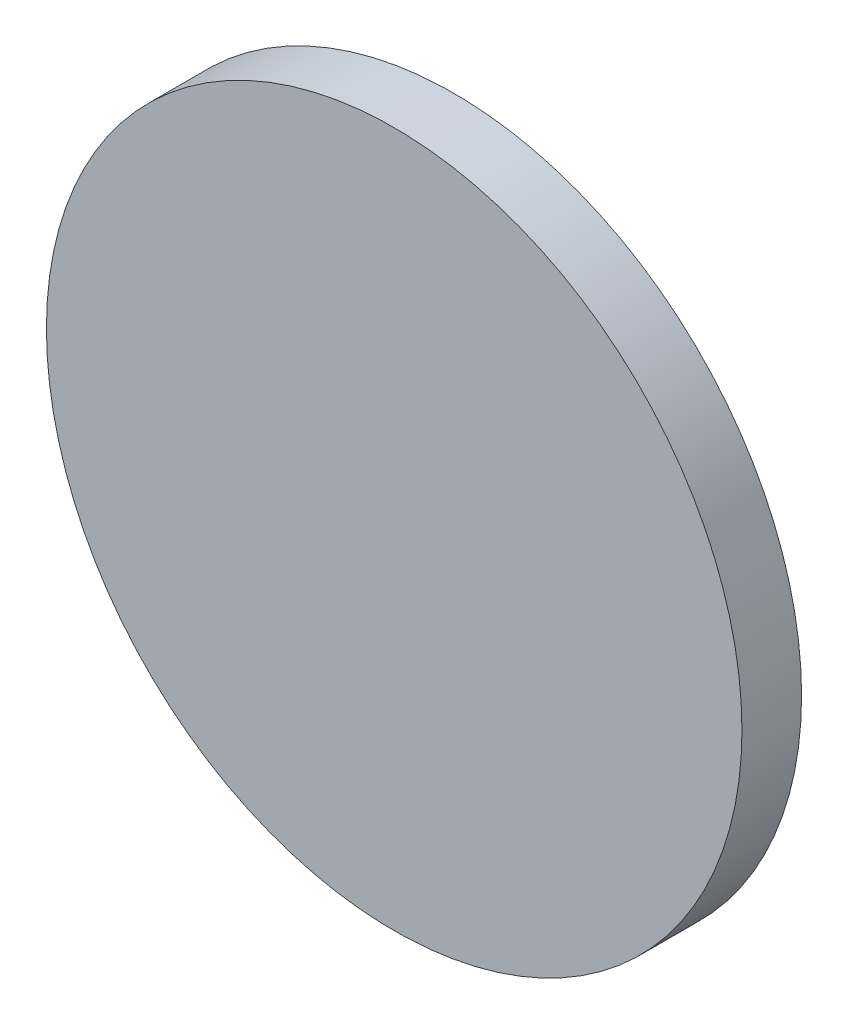
ISO-10303-21;
HEADER;
FILE_DESCRIPTION(('STEP AP214'),'2;1');
FILE_NAME('part.step','',(''),(''),'','','');
FILE_SCHEMA(('AUTOMOTIVE_DESIGN { 1 0 10303 214 1 1 1 1 }'));
ENDSEC;
DATA;
#1=APPLICATION_CONTEXT('core data for automotive mechanical design processes');
#2=APPLICATION_PROTOCOL_DEFINITION('international standard','automotive_design',2000,#1);
#3=PRODUCT_CONTEXT('',#1,'mechanical');
#4=PRODUCT('Part','Part','',(#3));
#5=PRODUCT_RELATED_PRODUCT_CATEGORY('part','',(#4));
#6=PRODUCT_DEFINITION_FORMATION('','',#4);
#7=PRODUCT_DEFINITION_CONTEXT('part definition',#1,'design');
#8=PRODUCT_DEFINITION('design','',#6,#7);
#9=PRODUCT_DEFINITION_SHAPE('','',#8);
#10=(LENGTH_UNIT() NAMED_UNIT(*) SI_UNIT(.MILLI.,.METRE.));
#11=(NAMED_UNIT(*) PLANE_ANGLE_UNIT() SI_UNIT($,.RADIAN.));
#12=(NAMED_UNIT(*) SI_UNIT($,.STERADIAN.) SOLID_ANGLE_UNIT());
#13=UNCERTAINTY_MEASURE_WITH_UNIT(LENGTH_MEASURE(1.E-05),#10,'distance_accuracy_value','');
#14=(GEOMETRIC_REPRESENTATION_CONTEXT(3) GLOBAL_UNCERTAINTY_ASSIGNED_CONTEXT((#13)) GLOBAL_UNIT_ASSIGNED_CONTEXT((#10,
#11,#12)) REPRESENTATION_CONTEXT('',''));
#15=CARTESIAN_POINT('',(0.,0.,0.));
#16=DIRECTION('',(0.,0.,1.));
#17=DIRECTION('',(1.,0.,0.));
#18=AXIS2_PLACEMENT_3D('',#15,#16,#17);
#19=CARTESIAN_POINT('',(5.918,9.291,0.76487));
#20=DIRECTION('',(0.,0.,-1.));
#21=DIRECTION('',(-1.,0.,0.));
#22=AXIS2_PLACEMENT_3D('',#19,#20,#21);
#23=PLANE('',#22);
#24=CARTESIAN_POINT('',(5.918,9.291,0.76487));
#25=DIRECTION('',(0.,0.,1.));
#26=DIRECTION('',(1.,0.,0.));
#27=AXIS2_PLACEMENT_3D('',#24,#25,#26);
#28=CIRCLE('',#27,0.200024667);
#29=CARTESIAN_POINT('',(6.118024667,9.291,0.76487));
#30=VERTEX_POINT('',#29);
#31=EDGE_CURVE('E18',#30,#30,#28,.T.);
#32=ORIENTED_EDGE('',*,*,#31,.F.);
#33=EDGE_LOOP('',(#32));
#34=FACE_BOUND('',#33,.T.);
#35=ADVANCED_FACE('F15',(#34),#23,.T.);
#36=CARTESIAN_POINT('',(5.918,9.291,0.76487));
#37=DIRECTION('',(0.,0.,1.));
#38=DIRECTION('',(1.,0.,0.));
#39=AXIS2_PLACEMENT_3D('',#36,#37,#38);
#40=CYLINDRICAL_SURFACE('',#39,0.200024667);
#41=CARTESIAN_POINT('',(5.918,9.291,0.79916));
#42=DIRECTION('',(0.,0.,1.));
#43=DIRECTION('',(1.,0.,0.));
#44=AXIS2_PLACEMENT_3D('',#41,#42,#43);
#45=CIRCLE('',#44,0.200024667);
#46=CARTESIAN_POINT('',(6.118024667,9.291,0.79916));
#47=VERTEX_POINT('',#46);
#48=EDGE_CURVE('E10',#47,#47,#45,.T.);
#49=ORIENTED_EDGE('',*,*,#48,.F.);
#50=EDGE_LOOP('',(#49));
#51=FACE_BOUND('',#50,.T.);
#52=ORIENTED_EDGE('',*,*,#31,.T.);
#53=EDGE_LOOP('',(#52));
#54=FACE_BOUND('',#53,.T.);
#55=ADVANCED_FACE('F27',(#51,#54),#40,.T.);
#56=CARTESIAN_POINT('',(5.918,9.291,0.79916));
#57=DIRECTION('',(0.,0.,1.));
#58=DIRECTION('',(1.,0.,0.));
#59=AXIS2_PLACEMENT_3D('',#56,#57,#58);
#60=PLANE('',#59);
#61=ORIENTED_EDGE('',*,*,#48,.T.);
#62=EDGE_LOOP('',(#61));
#63=FACE_BOUND('',#62,.T.);
#64=ADVANCED_FACE('F34',(#63),#60,.T.);
#65=CLOSED_SHELL('',(#35,#55,#64));
#66=MANIFOLD_SOLID_BREP('B1',#65);
#67=ADVANCED_BREP_SHAPE_REPRESENTATION('',(#18,#66),#14);
#68=SHAPE_DEFINITION_REPRESENTATION(#9,#67);
ENDSEC;
END-ISO-10303-21;
